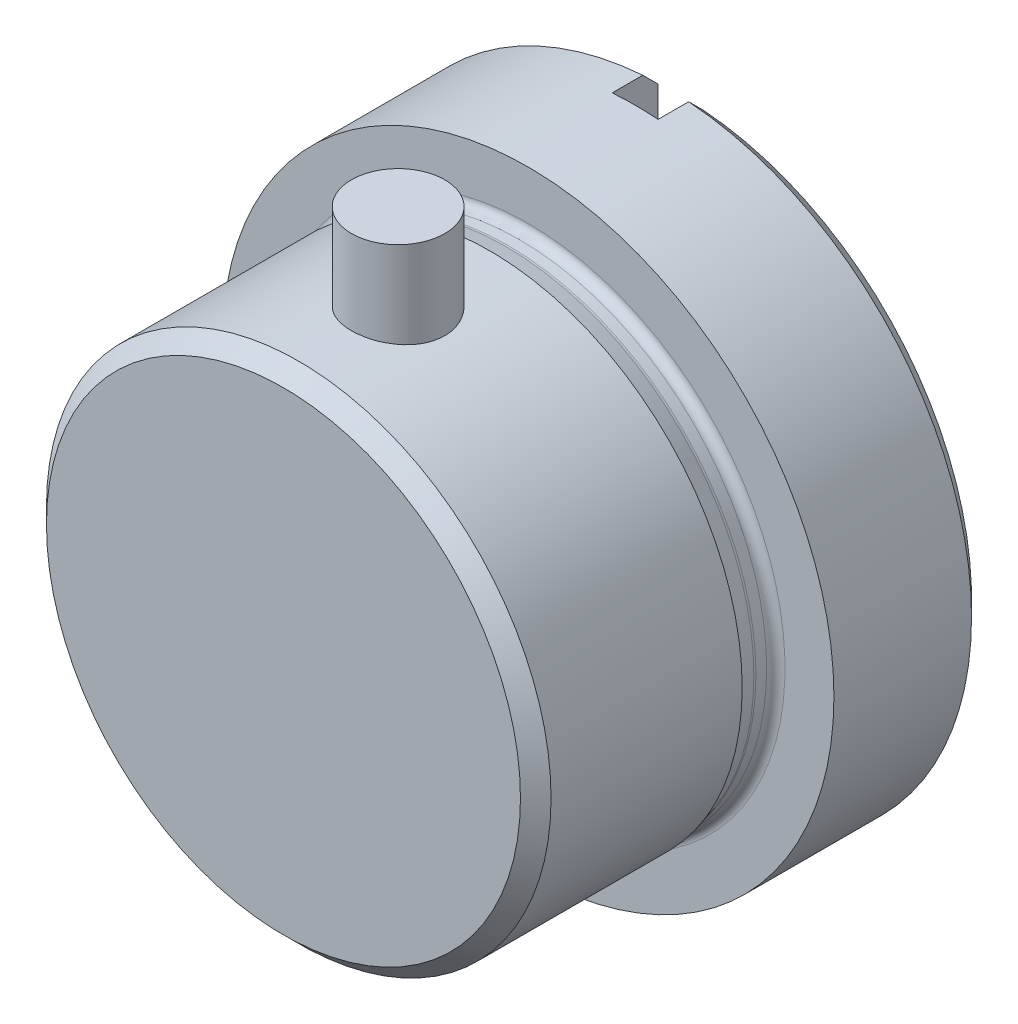
ISO-10303-21;
HEADER;
FILE_DESCRIPTION(('STEP AP214'),'2;1');
FILE_NAME('part.step','',(''),(''),'','','');
FILE_SCHEMA(('AUTOMOTIVE_DESIGN { 1 0 10303 214 1 1 1 1 }'));
ENDSEC;
DATA;
#1=APPLICATION_CONTEXT('core data for automotive mechanical design processes');
#2=APPLICATION_PROTOCOL_DEFINITION('international standard','automotive_design',2000,#1);
#3=PRODUCT_CONTEXT('',#1,'mechanical');
#4=PRODUCT('Part','Part','',(#3));
#5=PRODUCT_RELATED_PRODUCT_CATEGORY('part','',(#4));
#6=PRODUCT_DEFINITION_FORMATION('','',#4);
#7=PRODUCT_DEFINITION_CONTEXT('part definition',#1,'design');
#8=PRODUCT_DEFINITION('design','',#6,#7);
#9=PRODUCT_DEFINITION_SHAPE('','',#8);
#10=(LENGTH_UNIT() NAMED_UNIT(*) SI_UNIT(.MILLI.,.METRE.));
#11=(NAMED_UNIT(*) PLANE_ANGLE_UNIT() SI_UNIT($,.RADIAN.));
#12=(NAMED_UNIT(*) SI_UNIT($,.STERADIAN.) SOLID_ANGLE_UNIT());
#13=UNCERTAINTY_MEASURE_WITH_UNIT(LENGTH_MEASURE(1.E-05),#10,'distance_accuracy_value','');
#14=(GEOMETRIC_REPRESENTATION_CONTEXT(3) GLOBAL_UNCERTAINTY_ASSIGNED_CONTEXT((#13)) GLOBAL_UNIT_ASSIGNED_CONTEXT((#10,
#11,#12)) REPRESENTATION_CONTEXT('',''));
#15=CARTESIAN_POINT('',(0.,0.,0.));
#16=DIRECTION('',(0.,0.,1.));
#17=DIRECTION('',(1.,0.,0.));
#18=AXIS2_PLACEMENT_3D('',#15,#16,#17);
#19=CARTESIAN_POINT('',(0.,11.,-7.5));
#20=DIRECTION('',(0.,1.,0.));
#21=DIRECTION('',(0.,0.,1.));
#22=AXIS2_PLACEMENT_3D('',#19,#20,#21);
#23=CYLINDRICAL_SURFACE('',#22,3.05);
#24=CARTESIAN_POINT('',(0.,11.,-7.5));
#25=DIRECTION('',(0.,1.,0.));
#26=DIRECTION('',(0.,0.,1.));
#27=AXIS2_PLACEMENT_3D('',#24,#25,#26);
#28=CIRCLE('',#27,3.05);
#29=CARTESIAN_POINT('',(0.,11.,-4.45));
#30=VERTEX_POINT('',#29);
#31=EDGE_CURVE('E11',#30,#30,#28,.T.);
#32=ORIENTED_EDGE('',*,*,#31,.T.);
#33=EDGE_LOOP('',(#32));
#34=FACE_BOUND('',#33,.T.);
#35=CARTESIAN_POINT('',(0.,22.,-7.5));
#36=DIRECTION('',(0.,1.,0.));
#37=DIRECTION('',(0.,0.,1.));
#38=AXIS2_PLACEMENT_3D('',#35,#36,#37);
#39=CIRCLE('',#38,3.05);
#40=CARTESIAN_POINT('',(0.,22.,-4.45));
#41=VERTEX_POINT('',#40);
#42=EDGE_CURVE('E53',#41,#41,#39,.T.);
#43=ORIENTED_EDGE('',*,*,#42,.F.);
#44=EDGE_LOOP('',(#43));
#45=FACE_BOUND('',#44,.T.);
#46=ADVANCED_FACE('F47',(#34,#45),#23,.T.);
#47=CARTESIAN_POINT('',(0.,11.,-7.5));
#48=DIRECTION('',(0.,1.,0.));
#49=DIRECTION('',(0.,0.,1.));
#50=AXIS2_PLACEMENT_3D('',#47,#48,#49);
#51=PLANE('',#50);
#52=ORIENTED_EDGE('',*,*,#31,.F.);
#53=EDGE_LOOP('',(#52));
#54=FACE_BOUND('',#53,.T.);
#55=ADVANCED_FACE('F62',(#54),#51,.F.);
#56=CARTESIAN_POINT('',(0.,22.,-7.5));
#57=DIRECTION('',(0.,1.,0.));
#58=DIRECTION('',(0.,0.,1.));
#59=AXIS2_PLACEMENT_3D('',#56,#57,#58);
#60=PLANE('',#59);
#61=ORIENTED_EDGE('',*,*,#42,.T.);
#62=EDGE_LOOP('',(#61));
#63=FACE_BOUND('',#62,.T.);
#64=ADVANCED_FACE('F59',(#63),#60,.T.);
#65=CLOSED_SHELL('',(#46,#55,#64));
#66=MANIFOLD_SOLID_BREP('B2',#65);
#67=CARTESIAN_POINT('',(0.,20.,-26.));
#68=DIRECTION('',(0.,0.,1.));
#69=DIRECTION('',(1.,0.,0.));
#70=AXIS2_PLACEMENT_3D('',#67,#68,#69);
#71=PLANE('',#70);
#72=DIRECTION('',(0.,-1.,0.));
#73=VECTOR('',#72,1.);
#74=CARTESIAN_POINT('',(1.5,20.,-26.));
#75=LINE('',#74,#73);
#76=CARTESIAN_POINT('',(1.5,18.9406969248758,-26.));
#77=VERTEX_POINT('',#76);
#78=CARTESIAN_POINT('',(1.5,-18.9406969248758,-26.));
#79=VERTEX_POINT('',#78);
#80=EDGE_CURVE('E171',#77,#79,#75,.T.);
#81=ORIENTED_EDGE('',*,*,#80,.F.);
#82=CARTESIAN_POINT('',(0.,0.,-26.));
#83=DIRECTION('',(0.,0.,1.));
#84=DIRECTION('',(1.,0.,0.));
#85=AXIS2_PLACEMENT_3D('',#82,#83,#84);
#86=CIRCLE('',#85,19.);
#87=EDGE_CURVE('E275',#77,#79,#86,.F.);
#88=ORIENTED_EDGE('',*,*,#87,.T.);
#89=EDGE_LOOP('',(#81,#88));
#90=FACE_BOUND('',#89,.T.);
#91=ADVANCED_FACE('F88',(#90),#71,.F.);
#92=CARTESIAN_POINT('',(0.,0.,0.));
#93=DIRECTION('',(0.,0.,-1.));
#94=DIRECTION('',(-1.,0.,0.));
#95=AXIS2_PLACEMENT_3D('',#92,#93,#94);
#96=PLANE('',#95);
#97=CARTESIAN_POINT('',(0.,0.,0.));
#98=DIRECTION('',(0.,0.,-1.));
#99=DIRECTION('',(-1.,0.,0.));
#100=AXIS2_PLACEMENT_3D('',#97,#98,#99);
#101=CIRCLE('',#100,15.5);
#102=CARTESIAN_POINT('',(-15.5,0.,0.));
#103=VERTEX_POINT('',#102);
#104=EDGE_CURVE('E181',#103,#103,#101,.F.);
#105=ORIENTED_EDGE('',*,*,#104,.T.);
#106=EDGE_LOOP('',(#105));
#107=FACE_BOUND('',#106,.T.);
#108=ADVANCED_FACE('F249',(#107),#96,.F.);
#109=CARTESIAN_POINT('',(0.,0.,0.));
#110=DIRECTION('',(0.,0.,1.));
#111=DIRECTION('',(1.,0.,0.));
#112=AXIS2_PLACEMENT_3D('',#109,#110,#111);
#113=CYLINDRICAL_SURFACE('',#112,16.5);
#114=CARTESIAN_POINT('',(0.,0.,-13.5));
#115=DIRECTION('',(0.,0.,1.));
#116=DIRECTION('',(1.,0.,0.));
#117=AXIS2_PLACEMENT_3D('',#114,#115,#116);
#118=CIRCLE('',#117,16.5);
#119=CARTESIAN_POINT('',(16.5,0.,-13.5));
#120=VERTEX_POINT('',#119);
#121=EDGE_CURVE('E169',#120,#120,#118,.T.);
#122=ORIENTED_EDGE('',*,*,#121,.T.);
#123=EDGE_LOOP('',(#122));
#124=FACE_BOUND('',#123,.T.);
#125=CARTESIAN_POINT('',(0.,0.,-0.999999999999994));
#126=DIRECTION('',(0.,0.,-1.));
#127=DIRECTION('',(-1.,0.,0.));
#128=AXIS2_PLACEMENT_3D('',#125,#126,#127);
#129=CIRCLE('',#128,16.5);
#130=CARTESIAN_POINT('',(-16.5,0.,-0.999999999999994));
#131=VERTEX_POINT('',#130);
#132=EDGE_CURVE('E184',#131,#131,#129,.T.);
#133=ORIENTED_EDGE('',*,*,#132,.T.);
#134=EDGE_LOOP('',(#133));
#135=FACE_BOUND('',#134,.T.);
#136=ADVANCED_FACE('F246',(#124,#135),#113,.T.);
#137=CARTESIAN_POINT('',(0.,0.,0.));
#138=DIRECTION('',(0.,0.,-1.));
#139=DIRECTION('',(-1.,0.,0.));
#140=AXIS2_PLACEMENT_3D('',#137,#138,#139);
#141=CONICAL_SURFACE('',#140,15.5,0.785398163397448);
#142=ORIENTED_EDGE('',*,*,#132,.F.);
#143=EDGE_LOOP('',(#142));
#144=FACE_BOUND('',#143,.T.);
#145=ORIENTED_EDGE('',*,*,#104,.F.);
#146=EDGE_LOOP('',(#145));
#147=FACE_BOUND('',#146,.T.);
#148=ADVANCED_FACE('F235',(#144,#147),#141,.T.);
#149=CARTESIAN_POINT('',(0.,0.,-13.5));
#150=DIRECTION('',(0.,0.,-1.));
#151=DIRECTION('',(-1.,0.,0.));
#152=AXIS2_PLACEMENT_3D('',#149,#150,#151);
#153=CYLINDRICAL_SURFACE('',#152,16.2);
#154=CARTESIAN_POINT('',(0.,0.,-15.4));
#155=DIRECTION('',(0.,0.,-1.));
#156=DIRECTION('',(-1.,0.,0.));
#157=AXIS2_PLACEMENT_3D('',#154,#155,#156);
#158=CIRCLE('',#157,16.2);
#159=CARTESIAN_POINT('',(-16.2,0.,-15.4));
#160=VERTEX_POINT('',#159);
#161=EDGE_CURVE('E190',#160,#160,#158,.F.);
#162=ORIENTED_EDGE('',*,*,#161,.T.);
#163=EDGE_LOOP('',(#162));
#164=FACE_BOUND('',#163,.T.);
#165=CARTESIAN_POINT('',(0.,0.,-14.6986067408231));
#166=DIRECTION('',(0.,0.,-1.));
#167=DIRECTION('',(-1.,0.,0.));
#168=AXIS2_PLACEMENT_3D('',#165,#166,#167);
#169=CIRCLE('',#168,16.2);
#170=CARTESIAN_POINT('',(-16.2,0.,-14.6986067408231));
#171=VERTEX_POINT('',#170);
#172=EDGE_CURVE('E187',#171,#171,#169,.T.);
#173=ORIENTED_EDGE('',*,*,#172,.T.);
#174=EDGE_LOOP('',(#173));
#175=FACE_BOUND('',#174,.T.);
#176=ADVANCED_FACE('F230',(#164,#175),#153,.T.);
#177=DIRECTION('',(0.,1.,0.));
#178=VECTOR('',#177,1.);
#179=CARTESIAN_POINT('',(-1.5,20.,-26.));
#180=LINE('',#179,#178);
#181=CARTESIAN_POINT('',(-1.5,-18.9406969248758,-26.));
#182=VERTEX_POINT('',#181);
#183=CARTESIAN_POINT('',(-1.5,18.9406969248758,-26.));
#184=VERTEX_POINT('',#183);
#185=EDGE_CURVE('E167',#182,#184,#180,.T.);
#186=ORIENTED_EDGE('',*,*,#185,.F.);
#187=CARTESIAN_POINT('',(0.,0.,-26.));
#188=DIRECTION('',(0.,0.,1.));
#189=DIRECTION('',(1.,0.,0.));
#190=AXIS2_PLACEMENT_3D('',#187,#188,#189);
#191=CIRCLE('',#190,19.);
#192=EDGE_CURVE('E45',#182,#184,#191,.F.);
#193=ORIENTED_EDGE('',*,*,#192,.T.);
#194=EDGE_LOOP('',(#186,#193));
#195=FACE_BOUND('',#194,.T.);
#196=ADVANCED_FACE('F234',(#195),#71,.F.);
#197=CARTESIAN_POINT('',(0.,0.,0.));
#198=DIRECTION('',(0.,0.,1.));
#199=DIRECTION('',(1.,0.,0.));
#200=AXIS2_PLACEMENT_3D('',#197,#198,#199);
#201=CYLINDRICAL_SURFACE('',#200,20.);
#202=DIRECTION('',(0.,0.,1.));
#203=VECTOR('',#202,1.);
#204=CARTESIAN_POINT('',(1.5,-19.9436706751791,0.));
#205=LINE('',#204,#203);
#206=CARTESIAN_POINT('',(1.5,-19.9436706751791,-23.));
#207=VERTEX_POINT('',#206);
#208=CARTESIAN_POINT('',(1.5,-19.9436706751791,-25.));
#209=VERTEX_POINT('',#208);
#210=EDGE_CURVE('E162',#207,#209,#205,.F.);
#211=ORIENTED_EDGE('',*,*,#210,.T.);
#212=CARTESIAN_POINT('',(0.,0.,-25.));
#213=DIRECTION('',(0.,0.,1.));
#214=DIRECTION('',(1.,0.,0.));
#215=AXIS2_PLACEMENT_3D('',#212,#213,#214);
#216=CIRCLE('',#215,20.);
#217=CARTESIAN_POINT('',(1.5,19.9436706751791,-25.));
#218=VERTEX_POINT('',#217);
#219=EDGE_CURVE('E148',#209,#218,#216,.T.);
#220=ORIENTED_EDGE('',*,*,#219,.T.);
#221=DIRECTION('',(0.,0.,1.));
#222=VECTOR('',#221,1.);
#223=CARTESIAN_POINT('',(1.5,19.9436706751791,0.));
#224=LINE('',#223,#222);
#225=CARTESIAN_POINT('',(1.5,19.9436706751791,-23.));
#226=VERTEX_POINT('',#225);
#227=EDGE_CURVE('E139',#218,#226,#224,.T.);
#228=ORIENTED_EDGE('',*,*,#227,.T.);
#229=CARTESIAN_POINT('',(0.,0.,-23.));
#230=DIRECTION('',(0.,0.,-1.));
#231=DIRECTION('',(-1.,0.,0.));
#232=AXIS2_PLACEMENT_3D('',#229,#230,#231);
#233=CIRCLE('',#232,20.);
#234=CARTESIAN_POINT('',(-1.5,19.9436706751791,-23.));
#235=VERTEX_POINT('',#234);
#236=EDGE_CURVE('E145',#235,#226,#233,.T.);
#237=ORIENTED_EDGE('',*,*,#236,.F.);
#238=DIRECTION('',(0.,0.,1.));
#239=VECTOR('',#238,1.);
#240=CARTESIAN_POINT('',(-1.5,19.9436706751791,0.));
#241=LINE('',#240,#239);
#242=CARTESIAN_POINT('',(-1.5,19.9436706751791,-25.));
#243=VERTEX_POINT('',#242);
#244=EDGE_CURVE('E152',#235,#243,#241,.F.);
#245=ORIENTED_EDGE('',*,*,#244,.T.);
#246=CARTESIAN_POINT('',(0.,0.,-25.));
#247=DIRECTION('',(0.,0.,1.));
#248=DIRECTION('',(1.,0.,0.));
#249=AXIS2_PLACEMENT_3D('',#246,#247,#248);
#250=CIRCLE('',#249,20.);
#251=CARTESIAN_POINT('',(-1.5,-19.9436706751791,-25.));
#252=VERTEX_POINT('',#251);
#253=EDGE_CURVE('E151',#243,#252,#250,.T.);
#254=ORIENTED_EDGE('',*,*,#253,.T.);
#255=DIRECTION('',(0.,0.,1.));
#256=VECTOR('',#255,1.);
#257=CARTESIAN_POINT('',(-1.5,-19.9436706751791,0.));
#258=LINE('',#257,#256);
#259=CARTESIAN_POINT('',(-1.5,-19.9436706751791,-23.));
#260=VERTEX_POINT('',#259);
#261=EDGE_CURVE('E199',#252,#260,#258,.T.);
#262=ORIENTED_EDGE('',*,*,#261,.T.);
#263=EDGE_CURVE('E164',#207,#260,#233,.T.);
#264=ORIENTED_EDGE('',*,*,#263,.F.);
#265=EDGE_LOOP('',(#211,#220,#228,#237,#245,#254,#262,#264));
#266=FACE_BOUND('',#265,.T.);
#267=CARTESIAN_POINT('',(0.,0.,-16.));
#268=DIRECTION('',(0.,0.,1.));
#269=DIRECTION('',(1.,0.,0.));
#270=AXIS2_PLACEMENT_3D('',#267,#268,#269);
#271=CIRCLE('',#270,20.);
#272=CARTESIAN_POINT('',(20.,0.,-16.));
#273=VERTEX_POINT('',#272);
#274=EDGE_CURVE('E178',#273,#273,#271,.T.);
#275=ORIENTED_EDGE('',*,*,#274,.F.);
#276=EDGE_LOOP('',(#275));
#277=FACE_BOUND('',#276,.T.);
#278=ADVANCED_FACE('F142',(#266,#277),#201,.T.);
#279=CARTESIAN_POINT('',(0.,16.5,-16.));
#280=DIRECTION('',(0.,0.,-1.));
#281=DIRECTION('',(-1.,0.,0.));
#282=AXIS2_PLACEMENT_3D('',#279,#280,#281);
#283=PLANE('',#282);
#284=CARTESIAN_POINT('',(0.,0.,-16.));
#285=DIRECTION('',(0.,0.,-1.));
#286=DIRECTION('',(-1.,0.,0.));
#287=AXIS2_PLACEMENT_3D('',#284,#285,#286);
#288=CIRCLE('',#287,16.8);
#289=CARTESIAN_POINT('',(-16.8,0.,-16.));
#290=VERTEX_POINT('',#289);
#291=EDGE_CURVE('E193',#290,#290,#288,.T.);
#292=ORIENTED_EDGE('',*,*,#291,.T.);
#293=EDGE_LOOP('',(#292));
#294=FACE_BOUND('',#293,.T.);
#295=ORIENTED_EDGE('',*,*,#274,.T.);
#296=EDGE_LOOP('',(#295));
#297=FACE_BOUND('',#296,.T.);
#298=ADVANCED_FACE('F241',(#294,#297),#283,.F.);
#299=CARTESIAN_POINT('',(0.,0.,-13.5));
#300=DIRECTION('',(0.,0.,1.));
#301=DIRECTION('',(1.,0.,0.));
#302=AXIS2_PLACEMENT_3D('',#299,#300,#301);
#303=CONICAL_SURFACE('',#302,16.5,0.261799387799138);
#304=CARTESIAN_POINT('',(0.,0.,-14.5433153137616));
#305=DIRECTION('',(0.,0.,1.));
#306=DIRECTION('',(1.,0.,0.));
#307=AXIS2_PLACEMENT_3D('',#304,#305,#306);
#308=CIRCLE('',#307,16.2204445042266);
#309=CARTESIAN_POINT('',(16.2204445042266,0.,-14.5433153137616));
#310=VERTEX_POINT('',#309);
#311=EDGE_CURVE('E196',#310,#310,#308,.T.);
#312=ORIENTED_EDGE('',*,*,#311,.T.);
#313=EDGE_LOOP('',(#312));
#314=FACE_BOUND('',#313,.T.);
#315=ORIENTED_EDGE('',*,*,#121,.F.);
#316=EDGE_LOOP('',(#315));
#317=FACE_BOUND('',#316,.T.);
#318=ADVANCED_FACE('F244',(#314,#317),#303,.T.);
#319=CARTESIAN_POINT('',(0.,0.,-15.4));
#320=DIRECTION('',(0.,0.,-1.));
#321=DIRECTION('',(-1.,0.,0.));
#322=AXIS2_PLACEMENT_3D('',#319,#320,#321);
#323=TOROIDAL_SURFACE('',#322,16.8,0.6);
#324=ORIENTED_EDGE('',*,*,#291,.F.);
#325=EDGE_LOOP('',(#324));
#326=FACE_BOUND('',#325,.T.);
#327=ORIENTED_EDGE('',*,*,#161,.F.);
#328=EDGE_LOOP('',(#327));
#329=FACE_BOUND('',#328,.T.);
#330=ADVANCED_FACE('F259',(#326,#329),#323,.F.);
#331=CARTESIAN_POINT('',(0.,0.,-14.6986067408231));
#332=DIRECTION('',(0.,0.,-1.));
#333=DIRECTION('',(-1.,0.,0.));
#334=AXIS2_PLACEMENT_3D('',#331,#332,#333);
#335=TOROIDAL_SURFACE('',#334,16.8,0.6);
#336=ORIENTED_EDGE('',*,*,#311,.F.);
#337=EDGE_LOOP('',(#336));
#338=FACE_BOUND('',#337,.T.);
#339=ORIENTED_EDGE('',*,*,#172,.F.);
#340=EDGE_LOOP('',(#339));
#341=FACE_BOUND('',#340,.T.);
#342=ADVANCED_FACE('F227',(#338,#341),#335,.F.);
#343=CARTESIAN_POINT('',(1.5,20.,-23.));
#344=DIRECTION('',(1.,0.,0.));
#345=DIRECTION('',(0.,1.,0.));
#346=AXIS2_PLACEMENT_3D('',#343,#344,#345);
#347=PLANE('',#346);
#348=ORIENTED_EDGE('',*,*,#227,.F.);
#349=CARTESIAN_POINT('',(1.5,19.9436706751791,-25.));
#350=CARTESIAN_POINT('',(1.5,19.7765211106424,-25.1666794316821));
#351=CARTESIAN_POINT('',(1.5,19.6093651825186,-25.3333524808534));
#352=CARTESIAN_POINT('',(1.5,19.2750405990841,-25.6666858141868));
#353=CARTESIAN_POINT('',(1.5,19.1078719437735,-25.8333460983488));
#354=CARTESIAN_POINT('',(1.5,18.9406969248758,-26.));
#355=B_SPLINE_CURVE_WITH_KNOTS('',3,(#349,#350,#351,#352,#353,#354),.UNSPECIFIED.,.F.,.F.,(4,2,
4),(0.,0.708158941652912,1.41631788335877),.UNSPECIFIED.);
#356=EDGE_CURVE('E213',#218,#77,#355,.T.);
#357=ORIENTED_EDGE('',*,*,#356,.T.);
#358=ORIENTED_EDGE('',*,*,#80,.T.);
#359=CARTESIAN_POINT('',(1.5,-18.9406969248758,-26.));
#360=CARTESIAN_POINT('',(1.5,-19.1078719437735,-25.8333460983488));
#361=CARTESIAN_POINT('',(1.5,-19.2750405990841,-25.6666858141868));
#362=CARTESIAN_POINT('',(1.5,-19.6093651825186,-25.3333524808534));
#363=CARTESIAN_POINT('',(1.5,-19.7765211106424,-25.1666794316821));
#364=CARTESIAN_POINT('',(1.5,-19.9436706751791,-25.));
#365=B_SPLINE_CURVE_WITH_KNOTS('',3,(#359,#360,#361,#362,#363,#364),.UNSPECIFIED.,.F.,.F.,(4,2,
4),(0.,0.708158941705857,1.41631788335877),.UNSPECIFIED.);
#366=EDGE_CURVE('E206',#79,#209,#365,.T.);
#367=ORIENTED_EDGE('',*,*,#366,.T.);
#368=ORIENTED_EDGE('',*,*,#210,.F.);
#369=DIRECTION('',(0.,-1.,0.));
#370=VECTOR('',#369,1.);
#371=CARTESIAN_POINT('',(1.5,20.,-23.));
#372=LINE('',#371,#370);
#373=EDGE_CURVE('E159',#226,#207,#372,.T.);
#374=ORIENTED_EDGE('',*,*,#373,.F.);
#375=EDGE_LOOP('',(#348,#357,#358,#367,#368,#374));
#376=FACE_BOUND('',#375,.T.);
#377=ADVANCED_FACE('F166',(#376),#347,.F.);
#378=CARTESIAN_POINT('',(-1.5,20.,-23.));
#379=DIRECTION('',(-1.,0.,0.));
#380=DIRECTION('',(0.,-1.,0.));
#381=AXIS2_PLACEMENT_3D('',#378,#379,#380);
#382=PLANE('',#381);
#383=ORIENTED_EDGE('',*,*,#261,.F.);
#384=CARTESIAN_POINT('',(-1.5,-19.9436706751791,-25.));
#385=CARTESIAN_POINT('',(-1.5,-19.7765211106424,-25.1666794316821));
#386=CARTESIAN_POINT('',(-1.5,-19.6093651825186,-25.3333524808534));
#387=CARTESIAN_POINT('',(-1.5,-19.2750405990841,-25.6666858141868));
#388=CARTESIAN_POINT('',(-1.5,-19.1078719437735,-25.8333460983488));
#389=CARTESIAN_POINT('',(-1.5,-18.9406969248758,-26.));
#390=B_SPLINE_CURVE_WITH_KNOTS('',3,(#384,#385,#386,#387,#388,#389),.UNSPECIFIED.,.F.,.F.,(4,2,
4),(0.,0.708158941652915,1.41631788335877),.UNSPECIFIED.);
#391=EDGE_CURVE('E97',#252,#182,#390,.T.);
#392=ORIENTED_EDGE('',*,*,#391,.T.);
#393=ORIENTED_EDGE('',*,*,#185,.T.);
#394=CARTESIAN_POINT('',(-1.5,18.9406969248758,-26.));
#395=CARTESIAN_POINT('',(-1.5,19.1078719437735,-25.8333460983488));
#396=CARTESIAN_POINT('',(-1.5,19.2750405990841,-25.6666858141868));
#397=CARTESIAN_POINT('',(-1.5,19.6093651825186,-25.3333524808534));
#398=CARTESIAN_POINT('',(-1.5,19.7765211106424,-25.1666794316821));
#399=CARTESIAN_POINT('',(-1.5,19.9436706751791,-25.));
#400=B_SPLINE_CURVE_WITH_KNOTS('',3,(#394,#395,#396,#397,#398,#399),.UNSPECIFIED.,.F.,.F.,(4,2,
4),(0.,0.708158941705857,1.41631788335877),.UNSPECIFIED.);
#401=EDGE_CURVE('E278',#184,#243,#400,.T.);
#402=ORIENTED_EDGE('',*,*,#401,.T.);
#403=ORIENTED_EDGE('',*,*,#244,.F.);
#404=DIRECTION('',(0.,1.,0.));
#405=VECTOR('',#404,1.);
#406=CARTESIAN_POINT('',(-1.5,20.,-23.));
#407=LINE('',#406,#405);
#408=EDGE_CURVE('E161',#260,#235,#407,.T.);
#409=ORIENTED_EDGE('',*,*,#408,.F.);
#410=EDGE_LOOP('',(#383,#392,#393,#402,#403,#409));
#411=FACE_BOUND('',#410,.T.);
#412=ADVANCED_FACE('F226',(#411),#382,.F.);
#413=CARTESIAN_POINT('',(0.,0.,-23.));
#414=DIRECTION('',(0.,0.,-1.));
#415=DIRECTION('',(-1.,0.,0.));
#416=AXIS2_PLACEMENT_3D('',#413,#414,#415);
#417=PLANE('',#416);
#418=ORIENTED_EDGE('',*,*,#408,.T.);
#419=ORIENTED_EDGE('',*,*,#236,.T.);
#420=ORIENTED_EDGE('',*,*,#373,.T.);
#421=ORIENTED_EDGE('',*,*,#263,.T.);
#422=EDGE_LOOP('',(#418,#419,#420,#421));
#423=FACE_BOUND('',#422,.T.);
#424=ADVANCED_FACE('F157',(#423),#417,.T.);
#425=CARTESIAN_POINT('',(0.,0.,-25.));
#426=DIRECTION('',(0.,0.,1.));
#427=DIRECTION('',(1.,0.,0.));
#428=AXIS2_PLACEMENT_3D('',#425,#426,#427);
#429=CONICAL_SURFACE('',#428,20.,0.78539816339745);
#430=ORIENTED_EDGE('',*,*,#366,.F.);
#431=ORIENTED_EDGE('',*,*,#87,.F.);
#432=ORIENTED_EDGE('',*,*,#356,.F.);
#433=ORIENTED_EDGE('',*,*,#219,.F.);
#434=EDGE_LOOP('',(#430,#431,#432,#433));
#435=FACE_BOUND('',#434,.T.);
#436=ADVANCED_FACE('F219',(#435),#429,.T.);
#437=CARTESIAN_POINT('',(0.,0.,-25.));
#438=DIRECTION('',(0.,0.,1.));
#439=DIRECTION('',(1.,0.,0.));
#440=AXIS2_PLACEMENT_3D('',#437,#438,#439);
#441=CONICAL_SURFACE('',#440,20.,0.78539816339745);
#442=ORIENTED_EDGE('',*,*,#401,.F.);
#443=ORIENTED_EDGE('',*,*,#192,.F.);
#444=ORIENTED_EDGE('',*,*,#391,.F.);
#445=ORIENTED_EDGE('',*,*,#253,.F.);
#446=EDGE_LOOP('',(#442,#443,#444,#445));
#447=FACE_BOUND('',#446,.T.);
#448=ADVANCED_FACE('F90',(#447),#441,.T.);
#449=CLOSED_SHELL('',(#91,#108,#136,#148,#176,#196,#278,#298,#318,#330,#342,#377,#412,#424,#436,#448));
#450=MANIFOLD_SOLID_BREP('B6',#449);
#451=ADVANCED_BREP_SHAPE_REPRESENTATION('',(#18,#66,#450),#14);
#452=SHAPE_DEFINITION_REPRESENTATION(#9,#451);
ENDSEC;
END-ISO-10303-21;
